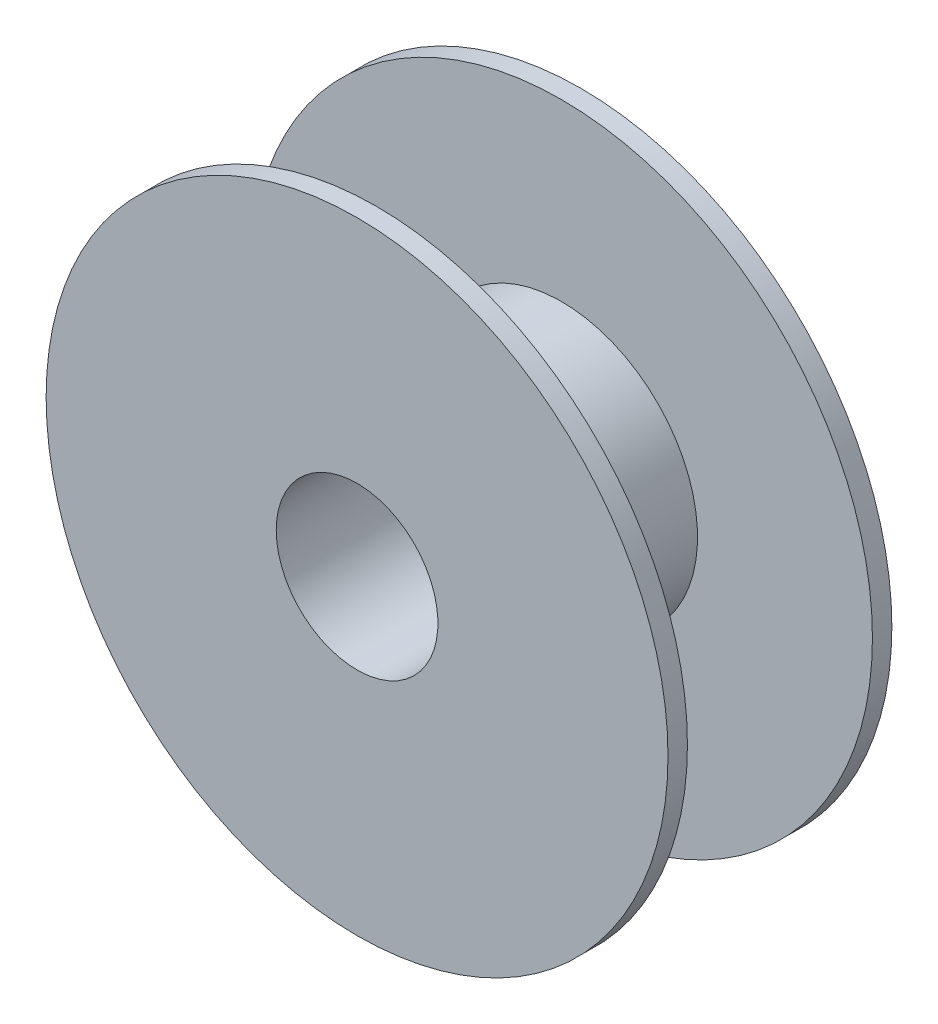
ISO-10303-21;
HEADER;
FILE_DESCRIPTION(('STEP AP214'),'2;1');
FILE_NAME('part.step','',(''),(''),'','','');
FILE_SCHEMA(('AUTOMOTIVE_DESIGN { 1 0 10303 214 1 1 1 1 }'));
ENDSEC;
DATA;
#1=APPLICATION_CONTEXT('core data for automotive mechanical design processes');
#2=APPLICATION_PROTOCOL_DEFINITION('international standard','automotive_design',2000,#1);
#3=PRODUCT_CONTEXT('',#1,'mechanical');
#4=PRODUCT('Part','Part','',(#3));
#5=PRODUCT_RELATED_PRODUCT_CATEGORY('part','',(#4));
#6=PRODUCT_DEFINITION_FORMATION('','',#4);
#7=PRODUCT_DEFINITION_CONTEXT('part definition',#1,'design');
#8=PRODUCT_DEFINITION('design','',#6,#7);
#9=PRODUCT_DEFINITION_SHAPE('','',#8);
#10=(LENGTH_UNIT() NAMED_UNIT(*) SI_UNIT(.MILLI.,.METRE.));
#11=(NAMED_UNIT(*) PLANE_ANGLE_UNIT() SI_UNIT($,.RADIAN.));
#12=(NAMED_UNIT(*) SI_UNIT($,.STERADIAN.) SOLID_ANGLE_UNIT());
#13=UNCERTAINTY_MEASURE_WITH_UNIT(LENGTH_MEASURE(1.E-05),#10,'distance_accuracy_value','');
#14=(GEOMETRIC_REPRESENTATION_CONTEXT(3) GLOBAL_UNCERTAINTY_ASSIGNED_CONTEXT((#13)) GLOBAL_UNIT_ASSIGNED_CONTEXT((#10,
#11,#12)) REPRESENTATION_CONTEXT('',''));
#15=CARTESIAN_POINT('',(0.,0.,0.));
#16=DIRECTION('',(0.,0.,1.));
#17=DIRECTION('',(1.,0.,0.));
#18=AXIS2_PLACEMENT_3D('',#15,#16,#17);
#19=CARTESIAN_POINT('',(0.,0.,73.152));
#20=DIRECTION('',(0.,0.,-1.));
#21=DIRECTION('',(-1.,0.,0.));
#22=AXIS2_PLACEMENT_3D('',#19,#20,#21);
#23=CYLINDRICAL_SURFACE('',#22,101.6);
#24=CARTESIAN_POINT('',(0.,0.,66.802));
#25=DIRECTION('',(0.,0.,-1.));
#26=DIRECTION('',(-1.,0.,0.));
#27=AXIS2_PLACEMENT_3D('',#24,#25,#26);
#28=CIRCLE('',#27,101.6);
#29=CARTESIAN_POINT('',(-101.6,0.,66.802));
#30=VERTEX_POINT('',#29);
#31=EDGE_CURVE('E52',#30,#30,#28,.T.);
#32=ORIENTED_EDGE('',*,*,#31,.F.);
#33=EDGE_LOOP('',(#32));
#34=FACE_BOUND('',#33,.T.);
#35=CARTESIAN_POINT('',(0.,0.,73.152));
#36=DIRECTION('',(0.,0.,1.));
#37=DIRECTION('',(1.,0.,0.));
#38=AXIS2_PLACEMENT_3D('',#35,#36,#37);
#39=CIRCLE('',#38,101.6);
#40=CARTESIAN_POINT('',(101.6,0.,73.152));
#41=VERTEX_POINT('',#40);
#42=EDGE_CURVE('E10',#41,#41,#39,.T.);
#43=ORIENTED_EDGE('',*,*,#42,.F.);
#44=EDGE_LOOP('',(#43));
#45=FACE_BOUND('',#44,.T.);
#46=ADVANCED_FACE('F31',(#34,#45),#23,.T.);
#47=CARTESIAN_POINT('',(0.,0.,73.152));
#48=DIRECTION('',(0.,0.,1.));
#49=DIRECTION('',(1.,0.,0.));
#50=AXIS2_PLACEMENT_3D('',#47,#48,#49);
#51=PLANE('',#50);
#52=CARTESIAN_POINT('',(0.,0.,73.152));
#53=DIRECTION('',(0.,0.,-1.));
#54=DIRECTION('',(-1.,0.,0.));
#55=AXIS2_PLACEMENT_3D('',#52,#53,#54);
#56=CIRCLE('',#55,26.416);
#57=CARTESIAN_POINT('',(-26.416,0.,73.152));
#58=VERTEX_POINT('',#57);
#59=EDGE_CURVE('E55',#58,#58,#56,.T.);
#60=ORIENTED_EDGE('',*,*,#59,.T.);
#61=EDGE_LOOP('',(#60));
#62=FACE_BOUND('',#61,.T.);
#63=ORIENTED_EDGE('',*,*,#42,.T.);
#64=EDGE_LOOP('',(#63));
#65=FACE_BOUND('',#64,.T.);
#66=ADVANCED_FACE('F62',(#62,#65),#51,.T.);
#67=CARTESIAN_POINT('',(0.,101.6,66.802));
#68=DIRECTION('',(0.,0.,1.));
#69=DIRECTION('',(1.,0.,0.));
#70=AXIS2_PLACEMENT_3D('',#67,#68,#69);
#71=PLANE('',#70);
#72=CARTESIAN_POINT('',(0.,0.,66.802));
#73=DIRECTION('',(0.,0.,-1.));
#74=DIRECTION('',(-1.,0.,0.));
#75=AXIS2_PLACEMENT_3D('',#72,#73,#74);
#76=CIRCLE('',#75,44.4500000000001);
#77=CARTESIAN_POINT('',(-44.4500000000001,0.,66.802));
#78=VERTEX_POINT('',#77);
#79=EDGE_CURVE('E42',#78,#78,#76,.T.);
#80=ORIENTED_EDGE('',*,*,#79,.F.);
#81=EDGE_LOOP('',(#80));
#82=FACE_BOUND('',#81,.T.);
#83=ORIENTED_EDGE('',*,*,#31,.T.);
#84=EDGE_LOOP('',(#83));
#85=FACE_BOUND('',#84,.T.);
#86=ADVANCED_FACE('F85',(#82,#85),#71,.F.);
#87=CARTESIAN_POINT('',(0.,0.,0.));
#88=DIRECTION('',(0.,0.,-1.));
#89=DIRECTION('',(-1.,0.,0.));
#90=AXIS2_PLACEMENT_3D('',#87,#88,#89);
#91=CYLINDRICAL_SURFACE('',#90,44.4500000000001);
#92=CARTESIAN_POINT('',(0.,0.,6.34999999999999));
#93=DIRECTION('',(0.,0.,-1.));
#94=DIRECTION('',(-1.,0.,0.));
#95=AXIS2_PLACEMENT_3D('',#92,#93,#94);
#96=CIRCLE('',#95,44.4500000000001);
#97=CARTESIAN_POINT('',(-44.4500000000001,0.,6.34999999999999));
#98=VERTEX_POINT('',#97);
#99=EDGE_CURVE('E46',#98,#98,#96,.T.);
#100=ORIENTED_EDGE('',*,*,#99,.F.);
#101=EDGE_LOOP('',(#100));
#102=FACE_BOUND('',#101,.T.);
#103=ORIENTED_EDGE('',*,*,#79,.T.);
#104=EDGE_LOOP('',(#103));
#105=FACE_BOUND('',#104,.T.);
#106=ADVANCED_FACE('F91',(#102,#105),#91,.T.);
#107=CARTESIAN_POINT('',(0.,44.4500000000001,6.35));
#108=DIRECTION('',(0.,0.,-1.));
#109=DIRECTION('',(-1.,0.,0.));
#110=AXIS2_PLACEMENT_3D('',#107,#108,#109);
#111=PLANE('',#110);
#112=CARTESIAN_POINT('',(0.,0.,6.35));
#113=DIRECTION('',(0.,0.,-1.));
#114=DIRECTION('',(-1.,0.,0.));
#115=AXIS2_PLACEMENT_3D('',#112,#113,#114);
#116=CIRCLE('',#115,101.6);
#117=CARTESIAN_POINT('',(-101.6,0.,6.35));
#118=VERTEX_POINT('',#117);
#119=EDGE_CURVE('E49',#118,#118,#116,.T.);
#120=ORIENTED_EDGE('',*,*,#119,.F.);
#121=EDGE_LOOP('',(#120));
#122=FACE_BOUND('',#121,.T.);
#123=ORIENTED_EDGE('',*,*,#99,.T.);
#124=EDGE_LOOP('',(#123));
#125=FACE_BOUND('',#124,.T.);
#126=ADVANCED_FACE('F73',(#122,#125),#111,.F.);
#127=CARTESIAN_POINT('',(0.,0.,0.));
#128=DIRECTION('',(0.,0.,1.));
#129=DIRECTION('',(1.,0.,0.));
#130=AXIS2_PLACEMENT_3D('',#127,#128,#129);
#131=PLANE('',#130);
#132=CARTESIAN_POINT('',(0.,0.,0.));
#133=DIRECTION('',(0.,0.,-1.));
#134=DIRECTION('',(-1.,0.,0.));
#135=AXIS2_PLACEMENT_3D('',#132,#133,#134);
#136=CIRCLE('',#135,26.416);
#137=CARTESIAN_POINT('',(-26.416,0.,0.));
#138=VERTEX_POINT('',#137);
#139=EDGE_CURVE('E56',#138,#138,#136,.T.);
#140=ORIENTED_EDGE('',*,*,#139,.F.);
#141=EDGE_LOOP('',(#140));
#142=FACE_BOUND('',#141,.T.);
#143=CARTESIAN_POINT('',(0.,0.,0.));
#144=DIRECTION('',(0.,0.,1.));
#145=DIRECTION('',(1.,0.,0.));
#146=AXIS2_PLACEMENT_3D('',#143,#144,#145);
#147=CIRCLE('',#146,101.6);
#148=CARTESIAN_POINT('',(101.6,0.,0.));
#149=VERTEX_POINT('',#148);
#150=EDGE_CURVE('E35',#149,#149,#147,.T.);
#151=ORIENTED_EDGE('',*,*,#150,.F.);
#152=EDGE_LOOP('',(#151));
#153=FACE_BOUND('',#152,.T.);
#154=ADVANCED_FACE('F70',(#142,#153),#131,.F.);
#155=ORIENTED_EDGE('',*,*,#119,.T.);
#156=EDGE_LOOP('',(#155));
#157=FACE_BOUND('',#156,.T.);
#158=ORIENTED_EDGE('',*,*,#150,.T.);
#159=EDGE_LOOP('',(#158));
#160=FACE_BOUND('',#159,.T.);
#161=ADVANCED_FACE('F33',(#157,#160),#23,.T.);
#162=CARTESIAN_POINT('',(0.,0.,73.152));
#163=DIRECTION('',(0.,0.,-1.));
#164=DIRECTION('',(-1.,0.,0.));
#165=AXIS2_PLACEMENT_3D('',#162,#163,#164);
#166=CYLINDRICAL_SURFACE('',#165,26.416);
#167=ORIENTED_EDGE('',*,*,#59,.F.);
#168=EDGE_LOOP('',(#167));
#169=FACE_BOUND('',#168,.T.);
#170=ORIENTED_EDGE('',*,*,#139,.T.);
#171=EDGE_LOOP('',(#170));
#172=FACE_BOUND('',#171,.T.);
#173=ADVANCED_FACE('F64',(#169,#172),#166,.F.);
#174=CLOSED_SHELL('',(#46,#66,#86,#106,#126,#154,#161,#173));
#175=MANIFOLD_SOLID_BREP('B2',#174);
#176=ADVANCED_BREP_SHAPE_REPRESENTATION('',(#18,#175),#14);
#177=SHAPE_DEFINITION_REPRESENTATION(#9,#176);
ENDSEC;
END-ISO-10303-21;
